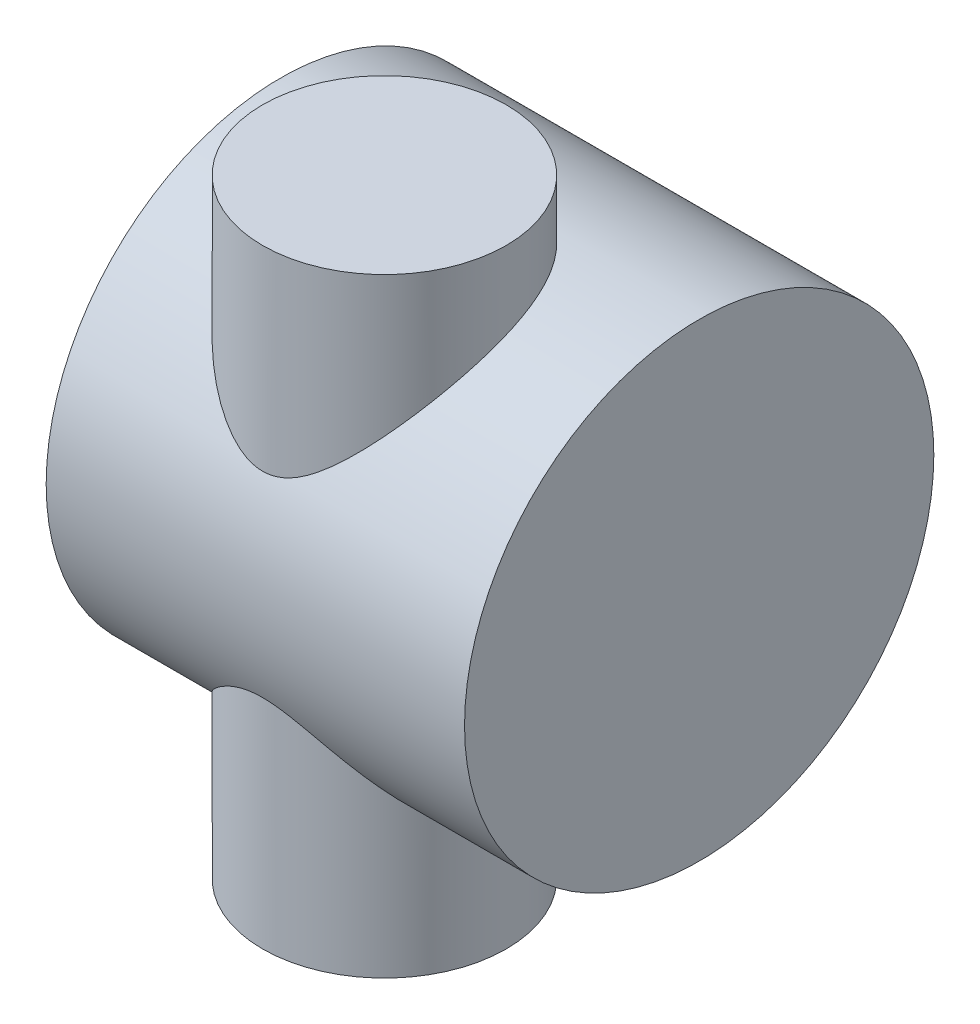
ISO-10303-21;
HEADER;
FILE_DESCRIPTION(('STEP AP214'),'2;1');
FILE_NAME('part.step','',(''),(''),'','','');
FILE_SCHEMA(('AUTOMOTIVE_DESIGN { 1 0 10303 214 1 1 1 1 }'));
ENDSEC;
DATA;
#1=APPLICATION_CONTEXT('core data for automotive mechanical design processes');
#2=APPLICATION_PROTOCOL_DEFINITION('international standard','automotive_design',2000,#1);
#3=PRODUCT_CONTEXT('',#1,'mechanical');
#4=PRODUCT('Part','Part','',(#3));
#5=PRODUCT_RELATED_PRODUCT_CATEGORY('part','',(#4));
#6=PRODUCT_DEFINITION_FORMATION('','',#4);
#7=PRODUCT_DEFINITION_CONTEXT('part definition',#1,'design');
#8=PRODUCT_DEFINITION('design','',#6,#7);
#9=PRODUCT_DEFINITION_SHAPE('','',#8);
#10=(LENGTH_UNIT() NAMED_UNIT(*) SI_UNIT(.MILLI.,.METRE.));
#11=(NAMED_UNIT(*) PLANE_ANGLE_UNIT() SI_UNIT($,.RADIAN.));
#12=(NAMED_UNIT(*) SI_UNIT($,.STERADIAN.) SOLID_ANGLE_UNIT());
#13=UNCERTAINTY_MEASURE_WITH_UNIT(LENGTH_MEASURE(1.E-05),#10,'distance_accuracy_value','');
#14=(GEOMETRIC_REPRESENTATION_CONTEXT(3) GLOBAL_UNCERTAINTY_ASSIGNED_CONTEXT((#13)) GLOBAL_UNIT_ASSIGNED_CONTEXT((#10,
#11,#12)) REPRESENTATION_CONTEXT('',''));
#15=CARTESIAN_POINT('',(0.,0.,0.));
#16=DIRECTION('',(0.,0.,1.));
#17=DIRECTION('',(1.,0.,0.));
#18=AXIS2_PLACEMENT_3D('',#15,#16,#17);
#19=CARTESIAN_POINT('',(0.,150.,0.));
#20=DIRECTION('',(0.,-1.,0.));
#21=DIRECTION('',(0.,0.,-1.));
#22=AXIS2_PLACEMENT_3D('',#19,#20,#21);
#23=CYLINDRICAL_SURFACE('',#22,30.);
#24=CARTESIAN_POINT('',(0.,135.011641284824,-30.));
#25=CARTESIAN_POINT('',(-0.841543689115784,135.011644923099,-29.9999959959224));
#26=CARTESIAN_POINT('',(-1.68317537297379,135.016319184397,-29.9645624327593));
#27=CARTESIAN_POINT('',(-3.36045600034876,135.034590226015,-29.8230766126563));
#28=CARTESIAN_POINT('',(-4.19610406182726,135.048188295483,-29.7170141525198));
#29=CARTESIAN_POINT('',(-5.85593564434072,135.083026414444,-29.4349638195009));
#30=CARTESIAN_POINT('',(-6.68011112486939,135.10427156835,-29.2589292321489));
#31=CARTESIAN_POINT('',(-8.31055251012137,135.152311548396,-28.8382307998302));
#32=CARTESIAN_POINT('',(-9.11681898980814,135.179106196084,-28.5935691615625));
#33=CARTESIAN_POINT('',(-10.7053773250901,135.235422350137,-28.0375224179784));
#34=CARTESIAN_POINT('',(-11.4876828400393,135.26494226288,-27.7261761681626));
#35=CARTESIAN_POINT('',(-13.0233978546944,135.323310374545,-27.038839336048));
#36=CARTESIAN_POINT('',(-13.7768070360063,135.352158566064,-26.6628480417087));
#37=CARTESIAN_POINT('',(-15.24948892462,135.405274866336,-25.84880916703));
#38=CARTESIAN_POINT('',(-15.9687619469808,135.429543017368,-25.4107621595816));
#39=CARTESIAN_POINT('',(-17.3681224220245,135.469219075064,-24.4756301790885));
#40=CARTESIAN_POINT('',(-18.0482100244973,135.484627015599,-23.9785454317434));
#41=CARTESIAN_POINT('',(-19.3652094514158,135.502073511876,-22.9281283403717));
#42=CARTESIAN_POINT('',(-20.0020608229552,135.504093715008,-22.3747198388784));
#43=CARTESIAN_POINT('',(-21.2268238409155,135.490080192277,-21.2163236147121));
#44=CARTESIAN_POINT('',(-21.8147352554872,135.474046380889,-20.6113356477129));
#45=CARTESIAN_POINT('',(-22.9369076320875,135.419369616077,-19.3547807382064));
#46=CARTESIAN_POINT('',(-23.4711872754198,135.380734567478,-18.7032301509667));
#47=CARTESIAN_POINT('',(-24.4821555072386,135.276559309476,-17.3588956319064));
#48=CARTESIAN_POINT('',(-24.9588469372927,135.211020428289,-16.6661137370765));
#49=CARTESIAN_POINT('',(-25.8322993625986,135.052601960173,-15.2754061155763));
#50=CARTESIAN_POINT('',(-26.2315743007791,134.960984440814,-14.5789149263914));
#51=CARTESIAN_POINT('',(-26.9713735178398,134.746739700556,-13.1599809314879));
#52=CARTESIAN_POINT('',(-27.3118996376879,134.624113451653,-12.4375389398278));
#53=CARTESIAN_POINT('',(-27.932306707916,134.345802462712,-10.9735196712296));
#54=CARTESIAN_POINT('',(-28.2122065346581,134.190128042401,-10.2319484310072));
#55=CARTESIAN_POINT('',(-28.7105947898131,133.844417310102,-8.73630634847185));
#56=CARTESIAN_POINT('',(-28.9290845926502,133.654381767311,-7.98223578630758));
#57=CARTESIAN_POINT('',(-29.2963622966445,133.248774881666,-6.50218792585727));
#58=CARTESIAN_POINT('',(-29.4478212801844,133.034717899995,-5.77645528930571));
#59=CARTESIAN_POINT('',(-29.6956373086092,132.575189173106,-4.32558936306589));
#60=CARTESIAN_POINT('',(-29.7919964622939,132.3297186306,-3.60045605150085));
#61=CARTESIAN_POINT('',(-29.9312242252778,131.808270914856,-2.15601080951358));
#62=CARTESIAN_POINT('',(-29.9740871782641,131.532290519079,-1.43669950265646));
#63=CARTESIAN_POINT('',(-30.0085008089731,130.951281068476,-0.00868569309692613));
#64=CARTESIAN_POINT('',(-30.0000490329343,130.646250625225,0.700016300666212));
#65=CARTESIAN_POINT('',(-29.9327715031251,129.992621629867,2.13870183581498));
#66=CARTESIAN_POINT('',(-29.8713850107968,129.642591077985,2.86791328706875));
#67=CARTESIAN_POINT('',(-29.6981736523494,128.914872415752,4.30618461337785));
#68=CARTESIAN_POINT('',(-29.5863483931471,128.537184089874,5.0152443313394));
#69=CARTESIAN_POINT('',(-29.3157387158828,127.756639348535,6.41034686873246));
#70=CARTESIAN_POINT('',(-29.1569413703286,127.353776028607,7.09638329382376));
#71=CARTESIAN_POINT('',(-28.7958389079343,126.525526190683,8.44309089471317));
#72=CARTESIAN_POINT('',(-28.5935249589761,126.100135113692,9.10375688920823));
#73=CARTESIAN_POINT('',(-28.2087331339487,125.346973733537,10.2233609549633));
#74=CARTESIAN_POINT('',(-28.0356148329307,125.023807547968,10.6886608343723));
#75=CARTESIAN_POINT('',(-27.6692096288231,124.367990608477,11.6042199057533));
#76=CARTESIAN_POINT('',(-27.4759263011315,124.035341543511,12.0544817454466));
#77=CARTESIAN_POINT('',(-26.8673165725002,123.024261477698,13.3826829887532));
#78=CARTESIAN_POINT('',(-26.423304004207,122.332840491369,14.2378266714764));
#79=CARTESIAN_POINT('',(-25.4658146686929,120.921701178752,15.8872355009384));
#80=CARTESIAN_POINT('',(-24.9521709500916,120.201917885549,16.6813469140657));
#81=CARTESIAN_POINT('',(-23.8624633233236,118.74305491671,18.2060645804166));
#82=CARTESIAN_POINT('',(-23.2864076502263,118.003977796582,18.9366791889815));
#83=CARTESIAN_POINT('',(-22.064581492433,116.499689756498,20.348026520115));
#84=CARTESIAN_POINT('',(-21.4176958914618,115.734249040379,21.0275501833152));
#85=CARTESIAN_POINT('',(-20.4037828111345,114.583326029993,21.9978260264702));
#86=CARTESIAN_POINT('',(-20.0584663847078,114.199139334312,22.3131474176682));
#87=CARTESIAN_POINT('',(-19.3532985338174,113.431069311542,22.9274625030854));
#88=CARTESIAN_POINT('',(-18.9934481840221,113.047185964154,23.2264574006883));
#89=CARTESIAN_POINT('',(-18.2601313552582,112.282177440383,23.8072625595155));
#90=CARTESIAN_POINT('',(-17.8867069358588,111.901047509448,24.0891196948473));
#91=CARTESIAN_POINT('',(-17.1249036736031,111.141969914267,24.6365113686289));
#92=CARTESIAN_POINT('',(-16.7365242317525,110.764022378226,24.9020452521743));
#93=CARTESIAN_POINT('',(-15.9444532641117,110.013355722834,25.4164772813399));
#94=CARTESIAN_POINT('',(-15.5407695946369,109.640634051907,25.6653837859967));
#95=CARTESIAN_POINT('',(-14.7171210519127,108.902494841647,26.1463914550934));
#96=CARTESIAN_POINT('',(-14.2971583422929,108.537076341376,26.3784948411385));
#97=CARTESIAN_POINT('',(-13.469671746441,107.841402240707,26.8098900174267));
#98=CARTESIAN_POINT('',(-13.0633219706785,107.510471323298,27.0103412053819));
#99=CARTESIAN_POINT('',(-12.2344061576369,106.860134979605,27.39577013837));
#100=CARTESIAN_POINT('',(-11.8118417752139,106.540728383575,27.5807494563608));
#101=CARTESIAN_POINT('',(-10.9480995739416,105.916257024786,27.9348796134292));
#102=CARTESIAN_POINT('',(-10.5068812124489,105.611226906707,28.1039931013764));
#103=CARTESIAN_POINT('',(-9.60518341950061,105.020897713591,28.4248035978289));
#104=CARTESIAN_POINT('',(-9.14470305804978,104.735599593011,28.5764997640753));
#105=CARTESIAN_POINT('',(-8.19514669472175,104.186155052262,28.8632919972862));
#106=CARTESIAN_POINT('',(-7.70572244030576,103.922439415404,28.9980699605888));
#107=CARTESIAN_POINT('',(-6.70415666034148,103.429464410383,29.2458600602056));
#108=CARTESIAN_POINT('',(-6.19201124308209,103.200210974691,29.3588684499521));
#109=CARTESIAN_POINT('',(-5.14787566533875,102.78701451713,29.5597786246701));
#110=CARTESIAN_POINT('',(-4.61600065467771,102.60284531167,29.6478061067374));
#111=CARTESIAN_POINT('',(-3.53268988072724,102.289176125266,29.7962755507713));
#112=CARTESIAN_POINT('',(-2.9812728465643,102.159625256087,29.8567431946846));
#113=CARTESIAN_POINT('',(-2.0632970668223,101.999392829667,29.9311449355397));
#114=CARTESIAN_POINT('',(-1.70066928869926,101.949937217927,29.953979103964));
#115=CARTESIAN_POINT('',(-0.97210564747405,101.879473211383,29.9864602857286));
#116=CARTESIAN_POINT('',(-0.606170724168046,101.858456975871,29.9961109337589));
#117=CARTESIAN_POINT('',(0.126346159347361,101.845704660757,30.0019704388398));
#118=CARTESIAN_POINT('',(0.49292817395728,101.853971172806,29.9981781061274));
#119=CARTESIAN_POINT('',(1.22390961104126,101.89945121608,29.9772540975938));
#120=CARTESIAN_POINT('',(1.5883088997423,101.936666503567,29.9601216124536));
#121=CARTESIAN_POINT('',(2.31043175889713,102.038356093861,29.9130762722481));
#122=CARTESIAN_POINT('',(2.66818050523609,102.102684577722,29.8832317753827));
#123=CARTESIAN_POINT('',(3.37707869313695,102.256367550103,29.8114484010333));
#124=CARTESIAN_POINT('',(3.7282253993635,102.345732177876,29.7695046233222));
#125=CARTESIAN_POINT('',(4.76993695839179,102.647538789816,29.6266536624456));
#126=CARTESIAN_POINT('',(5.44858246790196,102.893664233513,29.5087399604659));
#127=CARTESIAN_POINT('',(6.70540987936492,103.426416747392,29.2474028652808));
#128=CARTESIAN_POINT('',(7.28701043333495,103.70697299737,29.1074680980666));
#129=CARTESIAN_POINT('',(8.42114711324272,104.309336393176,28.7998180272222));
#130=CARTESIAN_POINT('',(8.97365952637114,104.631176481281,28.632080506923));
#131=CARTESIAN_POINT('',(10.0531080581547,105.306229348453,28.271189347877));
#132=CARTESIAN_POINT('',(10.5799478846263,105.659547996197,28.0779488018394));
#133=CARTESIAN_POINT('',(11.6084956332414,106.388367932387,27.6685575845612));
#134=CARTESIAN_POINT('',(12.1102077714054,106.763865476375,27.4524107757133));
#135=CARTESIAN_POINT('',(13.065570865744,107.511231959109,27.0102457315915));
#136=CARTESIAN_POINT('',(13.5203659250251,107.882288205403,26.7853124974555));
#137=CARTESIAN_POINT('',(14.4111813974452,108.63509460599,26.3167464475991));
#138=CARTESIAN_POINT('',(14.8471986828167,109.016846524489,26.0731105352811));
#139=CARTESIAN_POINT('',(15.7019072963211,109.788177521883,25.5674948441525));
#140=CARTESIAN_POINT('',(16.1205866740996,110.177761733301,25.3055027372552));
#141=CARTESIAN_POINT('',(16.9411893229451,110.962032847163,24.7636391360215));
#142=CARTESIAN_POINT('',(17.3431134710032,111.356719481118,24.4837685794137));
#143=CARTESIAN_POINT('',(18.1312655893469,112.149639108236,23.905986850151));
#144=CARTESIAN_POINT('',(18.5174757535461,112.547875533534,23.6080561147579));
#145=CARTESIAN_POINT('',(19.2740663826519,113.345757774105,22.9945118721004));
#146=CARTESIAN_POINT('',(19.6444467106032,113.745403601538,22.6788982119028));
#147=CARTESIAN_POINT('',(20.369362324569,114.54448790317,22.0301063234479));
#148=CARTESIAN_POINT('',(20.7239031058837,114.94392640101,21.6969342756406));
#149=CARTESIAN_POINT('',(21.4171612921644,115.741408519885,21.0129087514605));
#150=CARTESIAN_POINT('',(21.7558769769138,116.13945198495,20.6620533614538));
#151=CARTESIAN_POINT('',(22.7832697872462,117.372079089745,19.5443793531298));
#152=CARTESIAN_POINT('',(23.4444797649743,118.202357939527,18.7468604938533));
#153=CARTESIAN_POINT('',(24.3786401339286,119.430788618411,17.4915369400129));
#154=CARTESIAN_POINT('',(24.6804801272531,119.837525133996,17.0631503637973));
#155=CARTESIAN_POINT('',(25.2640399725238,120.6441779693,16.1865851540033));
#156=CARTESIAN_POINT('',(25.5457595796763,121.044094205997,15.73840627973));
#157=CARTESIAN_POINT('',(26.087250155468,121.834765974067,14.8235358623529));
#158=CARTESIAN_POINT('',(26.3470741528602,122.2255418791,14.3568933191017));
#159=CARTESIAN_POINT('',(26.8442658250641,122.997644818793,13.4042549164292));
#160=CARTESIAN_POINT('',(27.0816348382252,123.378972415584,12.9182602128807));
#161=CARTESIAN_POINT('',(27.5323655111467,124.130653657099,11.9274832064707));
#162=CARTESIAN_POINT('',(27.7457406244547,124.501013364905,11.4227116453725));
#163=CARTESIAN_POINT('',(28.1470881828956,125.229676363546,10.3945220917978));
#164=CARTESIAN_POINT('',(28.3350548426464,125.587976894663,9.87109988682705));
#165=CARTESIAN_POINT('',(28.747355319386,126.419116589073,8.61240676382786));
#166=CARTESIAN_POINT('',(28.9600058155248,126.886150929203,7.86940144138692));
#167=CARTESIAN_POINT('',(29.330029355045,127.791232668184,6.35282763474267));
#168=CARTESIAN_POINT('',(29.4874174104019,128.229287912888,5.57926751433409));
#169=CARTESIAN_POINT('',(29.7421282841962,129.072812135259,4.00514258491256));
#170=CARTESIAN_POINT('',(29.83946941767,129.478291016257,3.20458608877106));
#171=CARTESIAN_POINT('',(29.9693774932047,130.253331263658,1.58099968514258));
#172=CARTESIAN_POINT('',(30.0019426400011,130.62289163431,0.757969155429276));
#173=CARTESIAN_POINT('',(29.9978623873699,131.325750317274,-0.911063193130361));
#174=CARTESIAN_POINT('',(29.9606671597145,131.658738471531,-1.75719526724602));
#175=CARTESIAN_POINT('',(29.8122012936727,132.28253238914,-3.45856899738456));
#176=CARTESIAN_POINT('',(29.700930176294,132.573337879713,-4.31381071227734));
#177=CARTESIAN_POINT('',(29.4017293620804,133.111045818718,-6.02425659903409));
#178=CARTESIAN_POINT('',(29.2138388645748,133.357970624385,-6.87946056678561));
#179=CARTESIAN_POINT('',(28.7601437900039,133.807691040376,-8.58072491885093));
#180=CARTESIAN_POINT('',(28.4943488729019,134.01049211651,-9.42678642333007));
#181=CARTESIAN_POINT('',(27.9224303828957,134.350802560036,-10.9976783838293));
#182=CARTESIAN_POINT('',(27.625199691486,134.493261527556,-11.7246927087678));
#183=CARTESIAN_POINT('',(26.9721687046829,134.7464734734,-13.157577369345));
#184=CARTESIAN_POINT('',(26.6163737571372,134.857229344194,-13.8634496286405));
#185=CARTESIAN_POINT('',(25.8482282561802,135.049289853449,-15.2478116902644));
#186=CARTESIAN_POINT('',(25.4358809974626,135.130596206613,-15.9263030848025));
#187=CARTESIAN_POINT('',(24.5572892164051,135.266660145185,-17.2502388080408));
#188=CARTESIAN_POINT('',(24.0910438726972,135.321417325937,-17.8956826329036));
#189=CARTESIAN_POINT('',(23.1213574219097,135.406574312483,-19.1311945612257));
#190=CARTESIAN_POINT('',(22.6192843515025,135.437600004045,-19.7222950141421));
#191=CARTESIAN_POINT('',(21.570523197257,135.48113739131,-20.8641671229209));
#192=CARTESIAN_POINT('',(21.0238363582798,135.49364960341,-21.4149399032362));
#193=CARTESIAN_POINT('',(19.889213769993,135.503730774977,-22.4726702989974));
#194=CARTESIAN_POINT('',(19.3012663894197,135.501295503915,-22.9796154689103));
#195=CARTESIAN_POINT('',(18.0879518729665,135.485083060208,-23.9463513056969));
#196=CARTESIAN_POINT('',(17.462583430879,135.471305491439,-24.4061403250311));
#197=CARTESIAN_POINT('',(16.1436025768219,135.434996711646,-25.2992518069368));
#198=CARTESIAN_POINT('',(15.4481286186605,135.412033501266,-25.7298097959641));
#199=CARTESIAN_POINT('',(14.0244544737117,135.361388879606,-26.5326704921859));
#200=CARTESIAN_POINT('',(13.2962521781731,135.333707163982,-26.9049694386892));
#201=CARTESIAN_POINT('',(11.812279333544,135.277265230104,-27.5887150159582));
#202=CARTESIAN_POINT('',(11.0565217565338,135.248505519159,-27.9001898526686));
#203=CARTESIAN_POINT('',(9.52210603237015,135.193095316406,-28.4604353954943));
#204=CARTESIAN_POINT('',(8.74345085516744,135.166444552696,-28.7092141939377));
#205=CARTESIAN_POINT('',(7.30905071315056,135.122242987641,-29.1037462909751));
#206=CARTESIAN_POINT('',(6.65618491800349,135.103917020272,-29.2599638069651));
#207=CARTESIAN_POINT('',(5.34140597149598,135.07163956278,-29.5282817262356));
#208=CARTESIAN_POINT('',(4.67949401275746,135.05768750171,-29.6403878880764));
#209=CARTESIAN_POINT('',(3.34956495787555,135.035015691423,-29.8199704361605));
#210=CARTESIAN_POINT('',(2.68154798690875,135.026295835167,-29.8874477353977));
#211=CARTESIAN_POINT('',(1.34237296410974,135.01460676464,-29.9774673669517));
#212=CARTESIAN_POINT('',(0.67121447161128,135.01163838294,-30.0000031936486));
#213=CARTESIAN_POINT('',(0.,135.011641284824,-30.));
#214=B_SPLINE_CURVE_WITH_KNOTS('',3,(#24,#25,#26,#27,#28,#29,#30,#31,#32,#33,#34,#35,#36,#37,
#38,#39,#40,#41,#42,#43,#44,#45,#46,#47,#48,#49,#50,#51,#52,#53,#54,#55,#56,#57,#58,#59,#60,#61,
#62,#63,#64,#65,#66,#67,#68,#69,#70,#71,#72,#73,#74,#75,#76,#77,#78,#79,#80,#81,#82,#83,#84,#85,
#86,#87,#88,#89,#90,#91,#92,#93,#94,#95,#96,#97,#98,#99,#100,#101,#102,#103,#104,#105,#106,#107,
#108,#109,#110,#111,#112,#113,#114,#115,#116,#117,#118,#119,#120,#121,#122,#123,#124,#125,#126,
#127,#128,#129,#130,#131,#132,#133,#134,#135,#136,#137,#138,#139,#140,#141,#142,#143,#144,#145,
#146,#147,#148,#149,#150,#151,#152,#153,#154,#155,#156,#157,#158,#159,#160,#161,#162,#163,#164,
#165,#166,#167,#168,#169,#170,#171,#172,#173,#174,#175,#176,#177,#178,#179,#180,#181,#182,#183,
#184,#185,#186,#187,#188,#189,#190,#191,#192,#193,#194,#195,#196,#197,#198,#199,#200,#201,#202,
#203,#204,#205,#206,#207,#208,#209,#210,#211,#212,#213),.UNSPECIFIED.,.T.,.F.,(4,2,2,2,2,2,2,2,
2,2,2,2,2,2,2,2,2,2,2,2,2,2,2,2,2,2,2,2,2,2,2,2,2,2,2,2,2,2,2,2,2,2,2,2,2,2,2,2,2,2,2,2,2,2,2,2,
2,2,2,2,2,2,2,2,2,2,2,2,2,2,2,2,2,2,2,2,2,2,2,2,2,2,2,2,2,2,2,2,2,2,2,2,2,2,4),(0.,
2.52402709880351,5.04841890290544,7.57449886811708,10.1004976166795,12.6250285119956,
15.1495872158367,17.6741226147727,20.1986483627987,22.7266341479157,25.2546319084848,
27.7817460253884,30.3087353962665,32.7297337630318,35.1506562509965,37.5708238831566,
39.9909373449835,42.3032588430398,44.6154918372009,46.9279692899508,49.2405573213382,
51.6717248749934,54.1029113757328,56.5347676025914,58.9671178648338,60.7436421601863,
62.5198519991631,66.0730656164062,69.6349544713856,73.1963739169125,76.8253479985356,
78.6406390714045,80.45579616274,82.2657417592199,84.0757599251077,85.8848611889576,
87.693722826056,89.3764722938499,91.0590504753471,92.7454952665363,94.4320215757415,
96.1466019379274,97.8614771181797,99.5675639940423,101.272057766651,102.370934326457,
103.469507865346,104.568178635244,105.66691606437,106.759818234288,107.853163654172,
110.040429034072,112.019856995276,114.0008743746,115.988825777367,117.976442508844,
119.861490082918,121.746850439824,123.633489378856,125.520029444391,127.408650843469,
129.297288579056,131.185265908566,133.073447989395,137.050882556723,139.040508226674,
141.030158099201,143.014841798976,144.999407134127,146.982854101823,148.966751932805,
151.673107085466,154.378726490195,157.083520239764,159.788388951564,162.514666180877,
165.240961039115,167.96586284094,170.690426904244,173.082161899,175.473678611369,
177.865056054973,180.256469946247,182.582403527016,184.908272229278,187.234799243602,
189.561407514361,192.013485520551,194.465721746085,196.916818082268,199.36759788735,
201.380772299749,203.393683813041,205.406554145973,207.419715836052),.UNSPECIFIED.);
#215=CARTESIAN_POINT('',(0.,135.011641284824,-30.));
#216=VERTEX_POINT('',#215);
#217=EDGE_CURVE('E42',#216,#216,#214,.T.);
#218=ORIENTED_EDGE('',*,*,#217,.T.);
#219=EDGE_LOOP('',(#218));
#220=FACE_BOUND('',#219,.T.);
#221=CARTESIAN_POINT('',(0.,150.,0.));
#222=DIRECTION('',(0.,1.,0.));
#223=DIRECTION('',(0.,0.,1.));
#224=AXIS2_PLACEMENT_3D('',#221,#222,#223);
#225=CIRCLE('',#224,30.);
#226=CARTESIAN_POINT('',(0.,150.,30.));
#227=VERTEX_POINT('',#226);
#228=EDGE_CURVE('E10',#227,#227,#225,.T.);
#229=ORIENTED_EDGE('',*,*,#228,.F.);
#230=EDGE_LOOP('',(#229));
#231=FACE_BOUND('',#230,.T.);
#232=ADVANCED_FACE('F37',(#220,#231),#23,.T.);
#233=CARTESIAN_POINT('',(0.,150.,0.));
#234=DIRECTION('',(0.,1.,0.));
#235=DIRECTION('',(0.,0.,1.));
#236=AXIS2_PLACEMENT_3D('',#233,#234,#235);
#237=PLANE('',#236);
#238=ORIENTED_EDGE('',*,*,#228,.T.);
#239=EDGE_LOOP('',(#238));
#240=FACE_BOUND('',#239,.T.);
#241=ADVANCED_FACE('F73',(#240),#237,.T.);
#242=CARTESIAN_POINT('',(-48.,77.7315779711047,-22.4942309297563));
#243=DIRECTION('',(1.,0.,0.));
#244=DIRECTION('',(0.,0.,-1.));
#245=AXIS2_PLACEMENT_3D('',#242,#243,#244);
#246=CYLINDRICAL_SURFACE('',#245,57.7697344857977);
#247=CARTESIAN_POINT('',(-48.,77.7315779711047,-22.4942309297563));
#248=DIRECTION('',(1.,0.,0.));
#249=DIRECTION('',(0.,0.,-1.));
#250=AXIS2_PLACEMENT_3D('',#247,#248,#249);
#251=CIRCLE('',#250,57.7697344857977);
#252=CARTESIAN_POINT('',(-48.,77.7315779711047,-80.263965415554));
#253=VERTEX_POINT('',#252);
#254=EDGE_CURVE('E59',#253,#253,#251,.T.);
#255=ORIENTED_EDGE('',*,*,#254,.T.);
#256=EDGE_LOOP('',(#255));
#257=FACE_BOUND('',#256,.T.);
#258=CARTESIAN_POINT('',(55.,77.7315779711047,-22.4942309297563));
#259=DIRECTION('',(1.,0.,0.));
#260=DIRECTION('',(0.,0.,-1.));
#261=AXIS2_PLACEMENT_3D('',#258,#259,#260);
#262=CIRCLE('',#261,57.7697344857977);
#263=CARTESIAN_POINT('',(55.,77.7315779711047,-80.263965415554));
#264=VERTEX_POINT('',#263);
#265=EDGE_CURVE('E101',#264,#264,#262,.T.);
#266=ORIENTED_EDGE('',*,*,#265,.F.);
#267=EDGE_LOOP('',(#266));
#268=FACE_BOUND('',#267,.T.);
#269=CARTESIAN_POINT('',(0.,20.451514657385,-30.));
#270=CARTESIAN_POINT('',(0.841543689115785,20.4515110191102,-29.9999959959224));
#271=CARTESIAN_POINT('',(1.68317537297379,20.4468367578126,-29.9645624327593));
#272=CARTESIAN_POINT('',(3.36045600034876,20.4285657161945,-29.8230766126563));
#273=CARTESIAN_POINT('',(4.19610406182726,20.4149676467264,-29.7170141525198));
#274=CARTESIAN_POINT('',(5.85593564434072,20.3801295277659,-29.4349638195009));
#275=CARTESIAN_POINT('',(6.68011112486939,20.3588843738591,-29.2589292321489));
#276=CARTESIAN_POINT('',(8.31055251012137,20.3108443938134,-28.8382307998302));
#277=CARTESIAN_POINT('',(9.11681898980813,20.2840497461253,-28.5935691615625));
#278=CARTESIAN_POINT('',(10.7053773250901,20.227733592073,-28.0375224179784));
#279=CARTESIAN_POINT('',(11.4876828400393,20.1982136793291,-27.7261761681626));
#280=CARTESIAN_POINT('',(13.0233978546944,20.1398455676642,-27.038839336048));
#281=CARTESIAN_POINT('',(13.7768070360063,20.1109973761458,-26.6628480417087));
#282=CARTESIAN_POINT('',(15.24948892462,20.0578810758732,-25.84880916703));
#283=CARTESIAN_POINT('',(15.9687619469808,20.0336129248414,-25.4107621595816));
#284=CARTESIAN_POINT('',(17.3681224220245,19.9939368671453,-24.4756301790885));
#285=CARTESIAN_POINT('',(18.0482100244973,19.9785289266101,-23.9785454317434));
#286=CARTESIAN_POINT('',(19.3652094514158,19.9610824303333,-22.9281283403717));
#287=CARTESIAN_POINT('',(20.0020608229552,19.9590622272012,-22.3747198388784));
#288=CARTESIAN_POINT('',(21.2268238409155,19.9730757499328,-21.2163236147121));
#289=CARTESIAN_POINT('',(21.8147352554871,19.9891095613207,-20.6113356477129));
#290=CARTESIAN_POINT('',(22.9369076320875,20.0437863261323,-19.3547807382064));
#291=CARTESIAN_POINT('',(23.4711872754197,20.0824213747319,-18.7032301509667));
#292=CARTESIAN_POINT('',(24.4821555072386,20.1865966327333,-17.3588956319064));
#293=CARTESIAN_POINT('',(24.9588469372927,20.2521355139206,-16.6661137370765));
#294=CARTESIAN_POINT('',(25.8322993625986,20.4105539820363,-15.2754061155763));
#295=CARTESIAN_POINT('',(26.2315743007791,20.5021715013958,-14.5789149263914));
#296=CARTESIAN_POINT('',(26.9713735178398,20.7164162416532,-13.159980931488));
#297=CARTESIAN_POINT('',(27.3118996376879,20.8390424905569,-12.4375389398278));
#298=CARTESIAN_POINT('',(27.932306707916,21.1173534794975,-10.9735196712296));
#299=CARTESIAN_POINT('',(28.2122065346581,21.2730278998087,-10.2319484310072));
#300=CARTESIAN_POINT('',(28.7105947898131,21.6187386321071,-8.73630634847187));
#301=CARTESIAN_POINT('',(28.9290845926502,21.808774174898,-7.98223578630759));
#302=CARTESIAN_POINT('',(29.2963622966445,22.214381060543,-6.50218792585729));
#303=CARTESIAN_POINT('',(29.4478212801844,22.4284380422147,-5.77645528930573));
#304=CARTESIAN_POINT('',(29.6956373086092,22.8879667691036,-4.3255893630659));
#305=CARTESIAN_POINT('',(29.7919964622939,23.1334373116099,-3.60045605150086));
#306=CARTESIAN_POINT('',(29.9312242252778,23.6548850273534,-2.1560108095136));
#307=CARTESIAN_POINT('',(29.9740871782641,23.9308654231307,-1.43669950265647));
#308=CARTESIAN_POINT('',(30.0085008089731,24.5118748737336,-0.00868569309693664));
#309=CARTESIAN_POINT('',(30.0000490329343,24.8169053169843,0.700016300666203));
#310=CARTESIAN_POINT('',(29.9327715031251,25.4705343123428,2.13870183581496));
#311=CARTESIAN_POINT('',(29.8713850107968,25.8205648642241,2.86791328706873));
#312=CARTESIAN_POINT('',(29.6981736523494,26.5482835264575,4.30618461337783));
#313=CARTESIAN_POINT('',(29.5863483931471,26.9259718523351,5.01524433133939));
#314=CARTESIAN_POINT('',(29.3157387158828,27.7065165936743,6.41034686873245));
#315=CARTESIAN_POINT('',(29.1569413703286,28.1093799136029,7.09638329382376));
#316=CARTESIAN_POINT('',(28.7958389079343,28.937629751526,8.44309089471316));
#317=CARTESIAN_POINT('',(28.5935249589761,29.363020828517,9.10375688920822));
#318=CARTESIAN_POINT('',(28.2087331339487,30.116182208672,10.2233609549633));
#319=CARTESIAN_POINT('',(28.0356148329307,30.4393483942411,10.6886608343723));
#320=CARTESIAN_POINT('',(27.6692096288231,31.0951653337321,11.6042199057533));
#321=CARTESIAN_POINT('',(27.4759263011315,31.4278143986985,12.0544817454466));
#322=CARTESIAN_POINT('',(26.8673165725002,32.4388944645118,13.3826829887532));
#323=CARTESIAN_POINT('',(26.423304004207,33.1303154508409,14.2378266714763));
#324=CARTESIAN_POINT('',(25.4658146686929,34.5414547634571,15.8872355009384));
#325=CARTESIAN_POINT('',(24.9521709500916,35.2612380566608,16.6813469140657));
#326=CARTESIAN_POINT('',(23.8624633233236,36.7201010254992,18.2060645804166));
#327=CARTESIAN_POINT('',(23.2864076502263,37.459178145627,18.9366791889815));
#328=CARTESIAN_POINT('',(22.064581492433,38.9634661857112,20.348026520115));
#329=CARTESIAN_POINT('',(21.4176958914618,39.7289069018308,21.0275501833152));
#330=CARTESIAN_POINT('',(20.4037828111345,40.8798299122169,21.9978260264701));
#331=CARTESIAN_POINT('',(20.0584663847078,41.2640166078974,22.3131474176682));
#332=CARTESIAN_POINT('',(19.3532985338174,42.0320866306675,22.9274625030854));
#333=CARTESIAN_POINT('',(18.9934481840222,42.415969978055,23.2264574006883));
#334=CARTESIAN_POINT('',(18.2601313552582,43.1809785018267,23.8072625595155));
#335=CARTESIAN_POINT('',(17.8867069358588,43.5621084327619,24.0891196948473));
#336=CARTESIAN_POINT('',(17.1249036736031,44.3211860279426,24.6365113686289));
#337=CARTESIAN_POINT('',(16.7365242317526,44.6991335639831,24.9020452521742));
#338=CARTESIAN_POINT('',(15.9444532641117,45.4498002193753,25.4164772813399));
#339=CARTESIAN_POINT('',(15.5407695946369,45.8225218903029,25.6653837859966));
#340=CARTESIAN_POINT('',(14.7171210519127,46.5606611005627,26.1463914550933));
#341=CARTESIAN_POINT('',(14.297158342293,46.9260796008335,26.3784948411385));
#342=CARTESIAN_POINT('',(13.469671746441,47.6217537015027,26.8098900174267));
#343=CARTESIAN_POINT('',(13.0633219706785,47.9526846189116,27.0103412053818));
#344=CARTESIAN_POINT('',(12.234406157637,48.6030209626045,27.39577013837));
#345=CARTESIAN_POINT('',(11.8118417752139,48.9224275586342,27.5807494563608));
#346=CARTESIAN_POINT('',(10.9480995739416,49.546898917423,27.9348796134292));
#347=CARTESIAN_POINT('',(10.5068812124489,49.8519290355026,28.1039931013764));
#348=CARTESIAN_POINT('',(9.60518341950063,50.4422582286181,28.4248035978289));
#349=CARTESIAN_POINT('',(9.1447030580498,50.7275563491981,28.5764997640753));
#350=CARTESIAN_POINT('',(8.19514669472177,51.2770008899471,28.8632919972862));
#351=CARTESIAN_POINT('',(7.70572244030577,51.5407165268054,28.9980699605888));
#352=CARTESIAN_POINT('',(6.70415666034148,52.0336915318267,29.2458600602056));
#353=CARTESIAN_POINT('',(6.1920112430821,52.2629449675184,29.3588684499521));
#354=CARTESIAN_POINT('',(5.14787566533875,52.6761414250791,29.5597786246701));
#355=CARTESIAN_POINT('',(4.61600065467772,52.8603106305393,29.6478061067374));
#356=CARTESIAN_POINT('',(3.53268988072726,53.1739798169436,29.7962755507713));
#357=CARTESIAN_POINT('',(2.98127284656431,53.3035306861222,29.8567431946846));
#358=CARTESIAN_POINT('',(2.06329706682232,53.4637631125426,29.9311449355397));
#359=CARTESIAN_POINT('',(1.70066928869928,53.5132187242825,29.953979103964));
#360=CARTESIAN_POINT('',(0.972105647474071,53.5836827308268,29.9864602857286));
#361=CARTESIAN_POINT('',(0.606170724168063,53.6046989663384,29.9961109337589));
#362=CARTESIAN_POINT('',(-0.126346159347346,53.6174512814526,30.0019704388398));
#363=CARTESIAN_POINT('',(-0.492928173957259,53.6091847694036,29.9981781061274));
#364=CARTESIAN_POINT('',(-1.22390961104124,53.5637047261292,29.9772540975938));
#365=CARTESIAN_POINT('',(-1.58830889974228,53.5264894386429,29.9601216124536));
#366=CARTESIAN_POINT('',(-2.31043175889712,53.4247998483485,29.9130762722481));
#367=CARTESIAN_POINT('',(-2.66818050523608,53.3604713644871,29.8832317753827));
#368=CARTESIAN_POINT('',(-3.37707869313694,53.206788392106,29.8114484010333));
#369=CARTESIAN_POINT('',(-3.72822539936348,53.1174237643336,29.7695046233222));
#370=CARTESIAN_POINT('',(-4.76993695839177,52.8156171523934,29.6266536624456));
#371=CARTESIAN_POINT('',(-5.44858246790194,52.5694917086967,29.5087399604659));
#372=CARTESIAN_POINT('',(-6.7054098793649,52.0367391948175,29.2474028652808));
#373=CARTESIAN_POINT('',(-7.28701043333493,51.7561829448399,29.1074680980666));
#374=CARTESIAN_POINT('',(-8.4211471132427,51.153819549033,28.7998180272222));
#375=CARTESIAN_POINT('',(-8.97365952637113,50.8319794609284,28.632080506923));
#376=CARTESIAN_POINT('',(-10.0531080581547,50.1569265937568,28.271189347877));
#377=CARTESIAN_POINT('',(-10.5799478846263,49.8036079460123,28.0779488018394));
#378=CARTESIAN_POINT('',(-11.6084956332414,49.0747880098222,27.6685575845612));
#379=CARTESIAN_POINT('',(-12.1102077714054,48.6992904658341,27.4524107757133));
#380=CARTESIAN_POINT('',(-13.065570865744,47.9519239831004,27.0102457315915));
#381=CARTESIAN_POINT('',(-13.5203659250251,47.5808677368065,26.7853124974555));
#382=CARTESIAN_POINT('',(-14.4111813974452,46.82806133622,26.3167464475991));
#383=CARTESIAN_POINT('',(-14.8471986828167,46.4463094177209,26.0731105352811));
#384=CARTESIAN_POINT('',(-15.701907296321,45.6749784203265,25.5674948441525));
#385=CARTESIAN_POINT('',(-16.1205866740996,45.2853942089082,25.3055027372552));
#386=CARTESIAN_POINT('',(-16.9411893229451,44.5011230950469,24.7636391360216));
#387=CARTESIAN_POINT('',(-17.3431134710031,44.1064364610917,24.4837685794137));
#388=CARTESIAN_POINT('',(-18.1312655893469,43.3135168339735,23.905986850151));
#389=CARTESIAN_POINT('',(-18.5174757535461,42.915280408675,23.6080561147579));
#390=CARTESIAN_POINT('',(-19.2740663826518,42.1173981681045,22.9945118721004));
#391=CARTESIAN_POINT('',(-19.6444467106032,41.717752340671,22.6788982119028));
#392=CARTESIAN_POINT('',(-20.369362324569,40.918668039039,22.0301063234479));
#393=CARTESIAN_POINT('',(-20.7239031058837,40.5192295411999,21.6969342756406));
#394=CARTESIAN_POINT('',(-21.4171612921643,39.7217474223241,21.0129087514605));
#395=CARTESIAN_POINT('',(-21.7558769769137,39.3237039572599,20.6620533614538));
#396=CARTESIAN_POINT('',(-22.7832697872462,38.0910768524643,19.5443793531298));
#397=CARTESIAN_POINT('',(-23.4444797649743,37.2607980026825,18.7468604938533));
#398=CARTESIAN_POINT('',(-24.3786401339286,36.0323673237982,17.491536940013));
#399=CARTESIAN_POINT('',(-24.680480127253,35.6256308082138,17.0631503637974));
#400=CARTESIAN_POINT('',(-25.2640399725238,34.8189779729092,16.1865851540033));
#401=CARTESIAN_POINT('',(-25.5457595796763,34.4190617362127,15.73840627973));
#402=CARTESIAN_POINT('',(-26.087250155468,33.6283899681427,14.8235358623529));
#403=CARTESIAN_POINT('',(-26.3470741528602,33.2376140631091,14.3568933191017));
#404=CARTESIAN_POINT('',(-26.8442658250641,32.4655111234162,13.4042549164292));
#405=CARTESIAN_POINT('',(-27.0816348382252,32.0841835266253,12.9182602128808));
#406=CARTESIAN_POINT('',(-27.5323655111467,31.3325022851107,11.9274832064707));
#407=CARTESIAN_POINT('',(-27.7457406244546,30.9621425773042,11.4227116453725));
#408=CARTESIAN_POINT('',(-28.1470881828956,30.2334795786633,10.3945220917978));
#409=CARTESIAN_POINT('',(-28.3350548426464,29.8751790475462,9.87109988682708));
#410=CARTESIAN_POINT('',(-28.747355319386,29.044039353137,8.61240676382788));
#411=CARTESIAN_POINT('',(-28.9600058155248,28.5770050130065,7.86940144138694));
#412=CARTESIAN_POINT('',(-29.330029355045,27.6719232740255,6.35282763474269));
#413=CARTESIAN_POINT('',(-29.4874174104019,27.2338680293215,5.57926751433411));
#414=CARTESIAN_POINT('',(-29.7421282841962,26.3903438069509,4.00514258491258));
#415=CARTESIAN_POINT('',(-29.83946941767,25.9848649259523,3.20458608877108));
#416=CARTESIAN_POINT('',(-29.9693774932047,25.2098246785512,1.5809996851426));
#417=CARTESIAN_POINT('',(-30.0019426400011,24.8402643078991,0.757969155429293));
#418=CARTESIAN_POINT('',(-29.9978623873699,24.1374056249359,-0.911063193130346));
#419=CARTESIAN_POINT('',(-29.9606671597145,23.804417470678,-1.75719526724601));
#420=CARTESIAN_POINT('',(-29.8122012936727,23.1806235530692,-3.45856899738455));
#421=CARTESIAN_POINT('',(-29.700930176294,22.8898180624961,-4.31381071227732));
#422=CARTESIAN_POINT('',(-29.4017293620804,22.3521101234915,-6.02425659903409));
#423=CARTESIAN_POINT('',(-29.2138388645748,22.1051853178246,-6.87946056678561));
#424=CARTESIAN_POINT('',(-28.7601437900039,21.6554649018332,-8.58072491885093));
#425=CARTESIAN_POINT('',(-28.4943488729019,21.4526638256997,-9.42678642333007));
#426=CARTESIAN_POINT('',(-27.9224303828957,21.1123533821735,-10.9976783838293));
#427=CARTESIAN_POINT('',(-27.625199691486,20.9698944146534,-11.7246927087678));
#428=CARTESIAN_POINT('',(-26.9721687046829,20.7166824688094,-13.157577369345));
#429=CARTESIAN_POINT('',(-26.6163737571372,20.6059265980159,-13.8634496286405));
#430=CARTESIAN_POINT('',(-25.8482282561802,20.4138660887606,-15.2478116902644));
#431=CARTESIAN_POINT('',(-25.4358809974626,20.3325597355969,-15.9263030848025));
#432=CARTESIAN_POINT('',(-24.5572892164051,20.1964957970245,-17.2502388080408));
#433=CARTESIAN_POINT('',(-24.0910438726972,20.141738616272,-17.8956826329036));
#434=CARTESIAN_POINT('',(-23.1213574219097,20.0565816297261,-19.1311945612257));
#435=CARTESIAN_POINT('',(-22.6192843515025,20.0255559381649,-19.7222950141421));
#436=CARTESIAN_POINT('',(-21.570523197257,19.9820185508998,-20.8641671229209));
#437=CARTESIAN_POINT('',(-21.0238363582798,19.9695063387992,-21.4149399032362));
#438=CARTESIAN_POINT('',(-19.889213769993,19.9594251672321,-22.4726702989974));
#439=CARTESIAN_POINT('',(-19.3012663894197,19.9618604382945,-22.9796154689103));
#440=CARTESIAN_POINT('',(-18.0879518729665,19.9780728820012,-23.9463513056969));
#441=CARTESIAN_POINT('',(-17.462583430879,19.9918504507705,-24.4061403250311));
#442=CARTESIAN_POINT('',(-16.1436025768219,20.0281592305639,-25.2992518069368));
#443=CARTESIAN_POINT('',(-15.4481286186605,20.0511224409437,-25.7298097959641));
#444=CARTESIAN_POINT('',(-14.0244544737117,20.1017670626032,-26.5326704921859));
#445=CARTESIAN_POINT('',(-13.2962521781731,20.1294487782273,-26.9049694386892));
#446=CARTESIAN_POINT('',(-11.812279333544,20.1858907121053,-27.5887150159582));
#447=CARTESIAN_POINT('',(-11.0565217565338,20.2146504230503,-27.9001898526686));
#448=CARTESIAN_POINT('',(-9.52210603237017,20.2700606258035,-28.4604353954943));
#449=CARTESIAN_POINT('',(-8.74345085516746,20.2967113895135,-28.7092141939377));
#450=CARTESIAN_POINT('',(-7.30905071315057,20.3409129545682,-29.1037462909751));
#451=CARTESIAN_POINT('',(-6.6561849180035,20.3592389219379,-29.2599638069651));
#452=CARTESIAN_POINT('',(-5.34140597149599,20.3915163794296,-29.5282817262356));
#453=CARTESIAN_POINT('',(-4.67949401275747,20.4054684404992,-29.6403878880764));
#454=CARTESIAN_POINT('',(-3.34956495787555,20.4281402507867,-29.8199704361605));
#455=CARTESIAN_POINT('',(-2.68154798690875,20.4368601070421,-29.8874477353977));
#456=CARTESIAN_POINT('',(-1.34237296410974,20.4485491775694,-29.9774673669517));
#457=CARTESIAN_POINT('',(-0.671214471611277,20.4515175592697,-30.0000031936486));
#458=CARTESIAN_POINT('',(0.,20.451514657385,-30.));
#459=B_SPLINE_CURVE_WITH_KNOTS('',3,(#269,#270,#271,#272,#273,#274,#275,#276,#277,#278,#279,
#280,#281,#282,#283,#284,#285,#286,#287,#288,#289,#290,#291,#292,#293,#294,#295,#296,#297,#298,
#299,#300,#301,#302,#303,#304,#305,#306,#307,#308,#309,#310,#311,#312,#313,#314,#315,#316,#317,
#318,#319,#320,#321,#322,#323,#324,#325,#326,#327,#328,#329,#330,#331,#332,#333,#334,#335,#336,
#337,#338,#339,#340,#341,#342,#343,#344,#345,#346,#347,#348,#349,#350,#351,#352,#353,#354,#355,
#356,#357,#358,#359,#360,#361,#362,#363,#364,#365,#366,#367,#368,#369,#370,#371,#372,#373,#374,
#375,#376,#377,#378,#379,#380,#381,#382,#383,#384,#385,#386,#387,#388,#389,#390,#391,#392,#393,
#394,#395,#396,#397,#398,#399,#400,#401,#402,#403,#404,#405,#406,#407,#408,#409,#410,#411,#412,
#413,#414,#415,#416,#417,#418,#419,#420,#421,#422,#423,#424,#425,#426,#427,#428,#429,#430,#431,
#432,#433,#434,#435,#436,#437,#438,#439,#440,#441,#442,#443,#444,#445,#446,#447,#448,#449,#450,
#451,#452,#453,#454,#455,#456,#457,#458),.UNSPECIFIED.,.T.,.F.,(4,2,2,2,2,2,2,2,2,2,2,2,2,2,2,2,
2,2,2,2,2,2,2,2,2,2,2,2,2,2,2,2,2,2,2,2,2,2,2,2,2,2,2,2,2,2,2,2,2,2,2,2,2,2,2,2,2,2,2,2,2,2,2,2,
2,2,2,2,2,2,2,2,2,2,2,2,2,2,2,2,2,2,2,2,2,2,2,2,2,2,2,2,2,2,4),(0.,2.52402709880351,
5.04841890290544,7.57449886811708,10.1004976166795,12.6250285119956,15.1495872158367,
17.6741226147727,20.1986483627987,22.7266341479157,25.2546319084848,27.7817460253884,
30.3087353962665,32.7297337630318,35.1506562509965,37.5708238831566,39.9909373449835,
42.3032588430398,44.6154918372009,46.9279692899508,49.2405573213382,51.6717248749934,
54.1029113757328,56.5347676025914,58.9671178648338,60.7436421601862,62.5198519991631,
66.0730656164062,69.6349544713856,73.1963739169125,76.8253479985356,78.6406390714045,
80.45579616274,82.2657417592199,84.0757599251076,85.8848611889576,87.693722826056,
89.3764722938499,91.0590504753471,92.7454952665363,94.4320215757415,96.1466019379274,
97.8614771181797,99.5675639940423,101.272057766651,102.370934326457,103.469507865346,
104.568178635244,105.66691606437,106.759818234288,107.853163654172,110.040429034072,
112.019856995276,114.0008743746,115.988825777367,117.976442508844,119.861490082918,
121.746850439824,123.633489378856,125.520029444391,127.408650843469,129.297288579056,
131.185265908566,133.073447989395,137.050882556723,139.040508226674,141.030158099201,
143.014841798976,144.999407134127,146.982854101823,148.966751932805,151.673107085466,
154.378726490195,157.083520239764,159.788388951564,162.514666180877,165.240961039115,
167.96586284094,170.690426904244,173.082161899,175.473678611369,177.865056054973,
180.256469946247,182.582403527016,184.908272229278,187.234799243602,189.561407514361,
192.013485520551,194.465721746085,196.916818082268,199.36759788735,201.380772299749,
203.393683813041,205.406554145973,207.419715836052),.UNSPECIFIED.);
#460=CARTESIAN_POINT('',(0.,20.451514657385,-30.));
#461=VERTEX_POINT('',#460);
#462=EDGE_CURVE('E61',#461,#461,#459,.T.);
#463=ORIENTED_EDGE('',*,*,#462,.F.);
#464=EDGE_LOOP('',(#463));
#465=FACE_BOUND('',#464,.T.);
#466=ORIENTED_EDGE('',*,*,#217,.F.);
#467=EDGE_LOOP('',(#466));
#468=FACE_BOUND('',#467,.T.);
#469=ADVANCED_FACE('F67',(#257,#268,#465,#468),#246,.T.);
#470=CARTESIAN_POINT('',(-48.,77.7315779711047,-22.4942309297563));
#471=DIRECTION('',(1.,0.,0.));
#472=DIRECTION('',(0.,0.,-1.));
#473=AXIS2_PLACEMENT_3D('',#470,#471,#472);
#474=PLANE('',#473);
#475=ORIENTED_EDGE('',*,*,#254,.F.);
#476=EDGE_LOOP('',(#475));
#477=FACE_BOUND('',#476,.T.);
#478=ADVANCED_FACE('F72',(#477),#474,.F.);
#479=CARTESIAN_POINT('',(55.,77.7315779711047,-22.4942309297563));
#480=DIRECTION('',(1.,0.,0.));
#481=DIRECTION('',(0.,0.,-1.));
#482=AXIS2_PLACEMENT_3D('',#479,#480,#481);
#483=PLANE('',#482);
#484=ORIENTED_EDGE('',*,*,#265,.T.);
#485=EDGE_LOOP('',(#484));
#486=FACE_BOUND('',#485,.T.);
#487=ADVANCED_FACE('F80',(#486),#483,.T.);
#488=CARTESIAN_POINT('',(0.,0.,0.));
#489=DIRECTION('',(0.,1.,0.));
#490=DIRECTION('',(0.,0.,1.));
#491=AXIS2_PLACEMENT_3D('',#488,#489,#490);
#492=PLANE('',#491);
#493=CARTESIAN_POINT('',(0.,0.,0.));
#494=DIRECTION('',(0.,1.,0.));
#495=DIRECTION('',(0.,0.,1.));
#496=AXIS2_PLACEMENT_3D('',#493,#494,#495);
#497=CIRCLE('',#496,30.);
#498=CARTESIAN_POINT('',(0.,0.,30.));
#499=VERTEX_POINT('',#498);
#500=EDGE_CURVE('E51',#499,#499,#497,.T.);
#501=ORIENTED_EDGE('',*,*,#500,.F.);
#502=EDGE_LOOP('',(#501));
#503=FACE_BOUND('',#502,.T.);
#504=ADVANCED_FACE('F78',(#503),#492,.F.);
#505=ORIENTED_EDGE('',*,*,#462,.T.);
#506=EDGE_LOOP('',(#505));
#507=FACE_BOUND('',#506,.T.);
#508=ORIENTED_EDGE('',*,*,#500,.T.);
#509=EDGE_LOOP('',(#508));
#510=FACE_BOUND('',#509,.T.);
#511=ADVANCED_FACE('F39',(#507,#510),#23,.T.);
#512=CLOSED_SHELL('',(#232,#241,#469,#478,#487,#504,#511));
#513=MANIFOLD_SOLID_BREP('B2',#512);
#514=ADVANCED_BREP_SHAPE_REPRESENTATION('',(#18,#513),#14);
#515=SHAPE_DEFINITION_REPRESENTATION(#9,#514);
ENDSEC;
END-ISO-10303-21;
